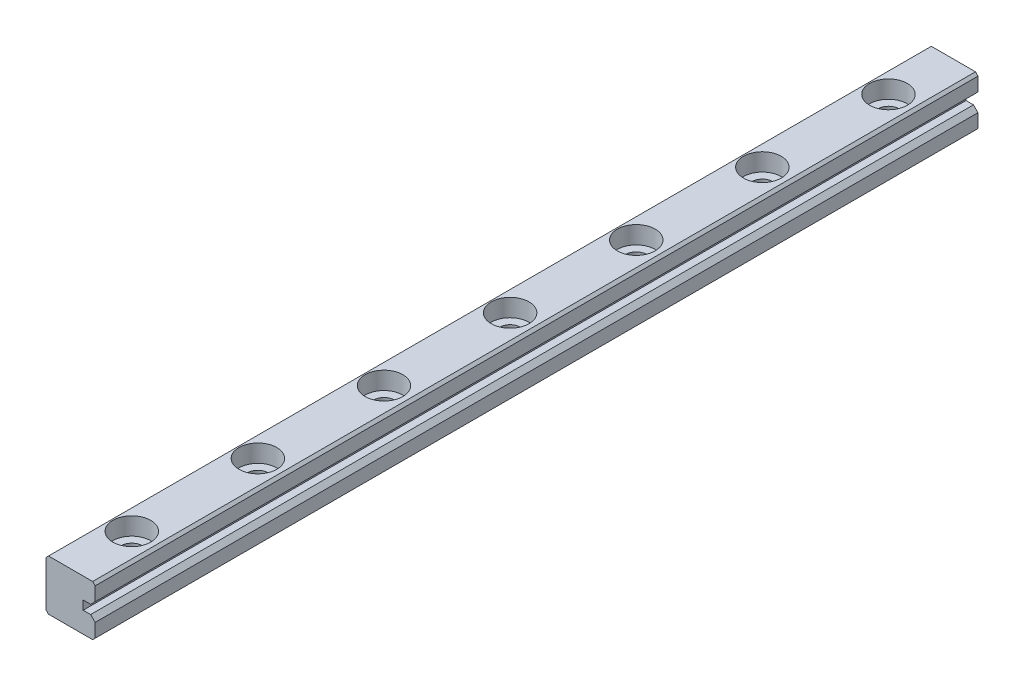
ISO-10303-21;
HEADER;
FILE_DESCRIPTION(('STEP AP214'),'2;1');
FILE_NAME('part.step','',(''),(''),'','','');
FILE_SCHEMA(('AUTOMOTIVE_DESIGN { 1 0 10303 214 1 1 1 1 }'));
ENDSEC;
DATA;
#1=APPLICATION_CONTEXT('core data for automotive mechanical design processes');
#2=APPLICATION_PROTOCOL_DEFINITION('international standard','automotive_design',2000,#1);
#3=PRODUCT_CONTEXT('',#1,'mechanical');
#4=PRODUCT('Part','Part','',(#3));
#5=PRODUCT_RELATED_PRODUCT_CATEGORY('part','',(#4));
#6=PRODUCT_DEFINITION_FORMATION('','',#4);
#7=PRODUCT_DEFINITION_CONTEXT('part definition',#1,'design');
#8=PRODUCT_DEFINITION('design','',#6,#7);
#9=PRODUCT_DEFINITION_SHAPE('','',#8);
#10=(LENGTH_UNIT() NAMED_UNIT(*) SI_UNIT(.MILLI.,.METRE.));
#11=(NAMED_UNIT(*) PLANE_ANGLE_UNIT() SI_UNIT($,.RADIAN.));
#12=(NAMED_UNIT(*) SI_UNIT($,.STERADIAN.) SOLID_ANGLE_UNIT());
#13=UNCERTAINTY_MEASURE_WITH_UNIT(LENGTH_MEASURE(1.E-05),#10,'distance_accuracy_value','');
#14=(GEOMETRIC_REPRESENTATION_CONTEXT(3) GLOBAL_UNCERTAINTY_ASSIGNED_CONTEXT((#13)) GLOBAL_UNIT_ASSIGNED_CONTEXT((#10,
#11,#12)) REPRESENTATION_CONTEXT('',''));
#15=CARTESIAN_POINT('',(0.,0.,0.));
#16=DIRECTION('',(0.,0.,1.));
#17=DIRECTION('',(1.,0.,0.));
#18=AXIS2_PLACEMENT_3D('',#15,#16,#17);
#19=CARTESIAN_POINT('',(2.95,1.65,-70.));
#20=DIRECTION('',(1.,0.,0.));
#21=DIRECTION('',(0.,0.,-1.));
#22=AXIS2_PLACEMENT_3D('',#19,#20,#21);
#23=PLANE('',#22);
#24=DIRECTION('',(0.,1.,0.));
#25=VECTOR('',#24,1.);
#26=CARTESIAN_POINT('',(2.95,1.65,-70.));
#27=LINE('',#26,#25);
#28=CARTESIAN_POINT('',(2.95,1.65,-70.));
#29=VERTEX_POINT('',#28);
#30=CARTESIAN_POINT('',(2.95,2.35,-70.));
#31=VERTEX_POINT('',#30);
#32=EDGE_CURVE('E114',#29,#31,#27,.T.);
#33=ORIENTED_EDGE('',*,*,#32,.T.);
#34=DIRECTION('',(0.,0.,-1.));
#35=VECTOR('',#34,1.);
#36=CARTESIAN_POINT('',(2.95,2.35,-70.));
#37=LINE('',#36,#35);
#38=CARTESIAN_POINT('',(2.95,2.35,0.));
#39=VERTEX_POINT('',#38);
#40=EDGE_CURVE('E136',#39,#31,#37,.T.);
#41=ORIENTED_EDGE('',*,*,#40,.F.);
#42=DIRECTION('',(0.,1.,0.));
#43=VECTOR('',#42,1.);
#44=CARTESIAN_POINT('',(2.95,1.65,0.));
#45=LINE('',#44,#43);
#46=CARTESIAN_POINT('',(2.95,1.65,0.));
#47=VERTEX_POINT('',#46);
#48=EDGE_CURVE('E122',#39,#47,#45,.F.);
#49=ORIENTED_EDGE('',*,*,#48,.T.);
#50=DIRECTION('',(0.,0.,1.));
#51=VECTOR('',#50,1.);
#52=CARTESIAN_POINT('',(2.95,1.65,-70.));
#53=LINE('',#52,#51);
#54=EDGE_CURVE('E133',#29,#47,#53,.T.);
#55=ORIENTED_EDGE('',*,*,#54,.F.);
#56=EDGE_LOOP('',(#33,#41,#49,#55));
#57=FACE_BOUND('',#56,.T.);
#58=ADVANCED_FACE('F16',(#57),#23,.T.);
#59=CARTESIAN_POINT('',(3.54,1.65,-70.));
#60=DIRECTION('',(0.,1.,0.));
#61=DIRECTION('',(-1.,0.,0.));
#62=AXIS2_PLACEMENT_3D('',#59,#60,#61);
#63=PLANE('',#62);
#64=DIRECTION('',(-1.,0.,0.));
#65=VECTOR('',#64,1.);
#66=CARTESIAN_POINT('',(3.54,1.65,-70.));
#67=LINE('',#66,#65);
#68=CARTESIAN_POINT('',(3.54,1.65,-70.));
#69=VERTEX_POINT('',#68);
#70=EDGE_CURVE('E130',#69,#29,#67,.T.);
#71=ORIENTED_EDGE('',*,*,#70,.T.);
#72=ORIENTED_EDGE('',*,*,#54,.T.);
#73=DIRECTION('',(-1.,0.,0.));
#74=VECTOR('',#73,1.);
#75=CARTESIAN_POINT('',(3.54,1.65,0.));
#76=LINE('',#75,#74);
#77=CARTESIAN_POINT('',(3.54,1.65,0.));
#78=VERTEX_POINT('',#77);
#79=EDGE_CURVE('E118',#47,#78,#76,.F.);
#80=ORIENTED_EDGE('',*,*,#79,.T.);
#81=DIRECTION('',(0.,0.,1.));
#82=VECTOR('',#81,1.);
#83=CARTESIAN_POINT('',(3.54,1.65,-70.));
#84=LINE('',#83,#82);
#85=EDGE_CURVE('E268',#69,#78,#84,.T.);
#86=ORIENTED_EDGE('',*,*,#85,.F.);
#87=EDGE_LOOP('',(#71,#72,#80,#86));
#88=FACE_BOUND('',#87,.T.);
#89=ADVANCED_FACE('F139',(#88),#63,.T.);
#90=CARTESIAN_POINT('',(2.95,2.35,-70.));
#91=DIRECTION('',(0.,-1.,0.));
#92=DIRECTION('',(0.,0.,-1.));
#93=AXIS2_PLACEMENT_3D('',#90,#91,#92);
#94=PLANE('',#93);
#95=DIRECTION('',(1.,0.,0.));
#96=VECTOR('',#95,1.);
#97=CARTESIAN_POINT('',(2.95,2.35,-70.));
#98=LINE('',#97,#96);
#99=CARTESIAN_POINT('',(3.54,2.35,-70.));
#100=VERTEX_POINT('',#99);
#101=EDGE_CURVE('E274',#31,#100,#98,.T.);
#102=ORIENTED_EDGE('',*,*,#101,.T.);
#103=DIRECTION('',(0.,0.,1.));
#104=VECTOR('',#103,1.);
#105=CARTESIAN_POINT('',(3.54,2.35,-70.));
#106=LINE('',#105,#104);
#107=CARTESIAN_POINT('',(3.54,2.35,0.));
#108=VERTEX_POINT('',#107);
#109=EDGE_CURVE('E262',#108,#100,#106,.F.);
#110=ORIENTED_EDGE('',*,*,#109,.F.);
#111=DIRECTION('',(1.,0.,0.));
#112=VECTOR('',#111,1.);
#113=CARTESIAN_POINT('',(2.95,2.35,0.));
#114=LINE('',#113,#112);
#115=EDGE_CURVE('E140',#108,#39,#114,.F.);
#116=ORIENTED_EDGE('',*,*,#115,.T.);
#117=ORIENTED_EDGE('',*,*,#40,.T.);
#118=EDGE_LOOP('',(#102,#110,#116,#117));
#119=FACE_BOUND('',#118,.T.);
#120=ADVANCED_FACE('F276',(#119),#94,.T.);
#121=CARTESIAN_POINT('',(3.9,1.29,-70.));
#122=DIRECTION('',(0.707106781186551,0.707106781186544,0.));
#123=DIRECTION('',(-0.707106781186544,0.707106781186551,0.));
#124=AXIS2_PLACEMENT_3D('',#121,#122,#123);
#125=PLANE('',#124);
#126=DIRECTION('',(-0.707106781186544,0.707106781186551,0.));
#127=VECTOR('',#126,1.);
#128=CARTESIAN_POINT('',(3.9,1.29,-70.));
#129=LINE('',#128,#127);
#130=CARTESIAN_POINT('',(3.9,1.29,-70.));
#131=VERTEX_POINT('',#130);
#132=EDGE_CURVE('E270',#131,#69,#129,.T.);
#133=ORIENTED_EDGE('',*,*,#132,.T.);
#134=ORIENTED_EDGE('',*,*,#85,.T.);
#135=DIRECTION('',(-0.707106781186544,0.707106781186551,0.));
#136=VECTOR('',#135,1.);
#137=CARTESIAN_POINT('',(3.9,1.29,0.));
#138=LINE('',#137,#136);
#139=CARTESIAN_POINT('',(3.9,1.29,0.));
#140=VERTEX_POINT('',#139);
#141=EDGE_CURVE('E125',#78,#140,#138,.F.);
#142=ORIENTED_EDGE('',*,*,#141,.T.);
#143=DIRECTION('',(0.,0.,-1.));
#144=VECTOR('',#143,1.);
#145=CARTESIAN_POINT('',(3.9,1.29,-70.));
#146=LINE('',#145,#144);
#147=EDGE_CURVE('E250',#131,#140,#146,.F.);
#148=ORIENTED_EDGE('',*,*,#147,.F.);
#149=EDGE_LOOP('',(#133,#134,#142,#148));
#150=FACE_BOUND('',#149,.T.);
#151=ADVANCED_FACE('F316',(#150),#125,.T.);
#152=CARTESIAN_POINT('',(3.9,2.71,-70.));
#153=DIRECTION('',(0.707106781186546,-0.707106781186549,0.));
#154=DIRECTION('',(0.707106781186549,0.707106781186546,0.));
#155=AXIS2_PLACEMENT_3D('',#152,#153,#154);
#156=PLANE('',#155);
#157=DIRECTION('',(0.707106781186549,0.707106781186546,0.));
#158=VECTOR('',#157,1.);
#159=CARTESIAN_POINT('',(3.9,2.71,-70.));
#160=LINE('',#159,#158);
#161=CARTESIAN_POINT('',(3.9,2.71,-70.));
#162=VERTEX_POINT('',#161);
#163=EDGE_CURVE('E259',#100,#162,#160,.T.);
#164=ORIENTED_EDGE('',*,*,#163,.T.);
#165=DIRECTION('',(0.,0.,-1.));
#166=VECTOR('',#165,1.);
#167=CARTESIAN_POINT('',(3.9,2.71,-70.));
#168=LINE('',#167,#166);
#169=CARTESIAN_POINT('',(3.9,2.71,0.));
#170=VERTEX_POINT('',#169);
#171=EDGE_CURVE('E235',#170,#162,#168,.T.);
#172=ORIENTED_EDGE('',*,*,#171,.F.);
#173=DIRECTION('',(0.707106781186549,0.707106781186546,0.));
#174=VECTOR('',#173,1.);
#175=CARTESIAN_POINT('',(3.9,2.71,0.));
#176=LINE('',#175,#174);
#177=EDGE_CURVE('E265',#170,#108,#176,.F.);
#178=ORIENTED_EDGE('',*,*,#177,.T.);
#179=ORIENTED_EDGE('',*,*,#109,.T.);
#180=EDGE_LOOP('',(#164,#172,#178,#179));
#181=FACE_BOUND('',#180,.T.);
#182=ADVANCED_FACE('F281',(#181),#156,.T.);
#183=CARTESIAN_POINT('',(3.9,1.29,-70.));
#184=DIRECTION('',(1.,0.,0.));
#185=DIRECTION('',(0.,0.,-1.));
#186=AXIS2_PLACEMENT_3D('',#183,#184,#185);
#187=PLANE('',#186);
#188=DIRECTION('',(0.,1.,0.));
#189=VECTOR('',#188,1.);
#190=CARTESIAN_POINT('',(3.9,1.29,-70.));
#191=LINE('',#190,#189);
#192=CARTESIAN_POINT('',(3.9,0.199999999999999,-70.));
#193=VERTEX_POINT('',#192);
#194=EDGE_CURVE('E253',#193,#131,#191,.T.);
#195=ORIENTED_EDGE('',*,*,#194,.T.);
#196=ORIENTED_EDGE('',*,*,#147,.T.);
#197=DIRECTION('',(0.,1.,0.));
#198=VECTOR('',#197,1.);
#199=CARTESIAN_POINT('',(3.9,1.29,0.));
#200=LINE('',#199,#198);
#201=CARTESIAN_POINT('',(3.9,0.199999999999999,0.));
#202=VERTEX_POINT('',#201);
#203=EDGE_CURVE('E256',#140,#202,#200,.F.);
#204=ORIENTED_EDGE('',*,*,#203,.T.);
#205=DIRECTION('',(0.,0.,1.));
#206=VECTOR('',#205,1.);
#207=CARTESIAN_POINT('',(3.9,0.199999999999998,-70.));
#208=LINE('',#207,#206);
#209=EDGE_CURVE('E297',#202,#193,#208,.F.);
#210=ORIENTED_EDGE('',*,*,#209,.T.);
#211=EDGE_LOOP('',(#195,#196,#204,#210));
#212=FACE_BOUND('',#211,.T.);
#213=ADVANCED_FACE('F307',(#212),#187,.T.);
#214=CARTESIAN_POINT('',(2.62500000000001,2.6,-65.));
#215=DIRECTION('',(0.,-1.,0.));
#216=DIRECTION('',(0.,0.,-1.));
#217=AXIS2_PLACEMENT_3D('',#214,#215,#216);
#218=PLANE('',#217);
#219=CARTESIAN_POINT('',(1.8,2.6,-65.));
#220=DIRECTION('',(0.,1.,0.));
#221=DIRECTION('',(0.,0.,1.));
#222=AXIS2_PLACEMENT_3D('',#219,#220,#221);
#223=CIRCLE('',#222,1.50000000000002);
#224=CARTESIAN_POINT('',(1.8,2.6,-63.5));
#225=VERTEX_POINT('',#224);
#226=EDGE_CURVE('E211',#225,#225,#223,.T.);
#227=ORIENTED_EDGE('',*,*,#226,.T.);
#228=EDGE_LOOP('',(#227));
#229=FACE_BOUND('',#228,.T.);
#230=CARTESIAN_POINT('',(1.8,2.6,-65.));
#231=DIRECTION('',(0.,1.,0.));
#232=DIRECTION('',(0.,0.,1.));
#233=AXIS2_PLACEMENT_3D('',#230,#231,#232);
#234=CIRCLE('',#233,0.825000000000006);
#235=CARTESIAN_POINT('',(1.8,2.6,-64.175));
#236=VERTEX_POINT('',#235);
#237=EDGE_CURVE('E19',#236,#236,#234,.F.);
#238=ORIENTED_EDGE('',*,*,#237,.T.);
#239=EDGE_LOOP('',(#238));
#240=FACE_BOUND('',#239,.T.);
#241=ADVANCED_FACE('F439',(#229,#240),#218,.F.);
#242=CARTESIAN_POINT('',(2.62500000000001,2.6,-55.));
#243=DIRECTION('',(0.,-1.,0.));
#244=DIRECTION('',(0.,0.,-1.));
#245=AXIS2_PLACEMENT_3D('',#242,#243,#244);
#246=PLANE('',#245);
#247=CARTESIAN_POINT('',(1.8,2.6,-55.));
#248=DIRECTION('',(0.,1.,0.));
#249=DIRECTION('',(0.,0.,1.));
#250=AXIS2_PLACEMENT_3D('',#247,#248,#249);
#251=CIRCLE('',#250,1.50000000000002);
#252=CARTESIAN_POINT('',(1.8,2.6,-53.5));
#253=VERTEX_POINT('',#252);
#254=EDGE_CURVE('E208',#253,#253,#251,.T.);
#255=ORIENTED_EDGE('',*,*,#254,.T.);
#256=EDGE_LOOP('',(#255));
#257=FACE_BOUND('',#256,.T.);
#258=CARTESIAN_POINT('',(1.8,2.6,-55.));
#259=DIRECTION('',(0.,1.,0.));
#260=DIRECTION('',(0.,0.,1.));
#261=AXIS2_PLACEMENT_3D('',#258,#259,#260);
#262=CIRCLE('',#261,0.825000000000013);
#263=CARTESIAN_POINT('',(1.8,2.6,-54.175));
#264=VERTEX_POINT('',#263);
#265=EDGE_CURVE('E230',#264,#264,#262,.F.);
#266=ORIENTED_EDGE('',*,*,#265,.T.);
#267=EDGE_LOOP('',(#266));
#268=FACE_BOUND('',#267,.T.);
#269=ADVANCED_FACE('F435',(#257,#268),#246,.F.);
#270=CARTESIAN_POINT('',(2.62500000000001,2.6,-45.));
#271=DIRECTION('',(0.,-1.,0.));
#272=DIRECTION('',(0.,0.,-1.));
#273=AXIS2_PLACEMENT_3D('',#270,#271,#272);
#274=PLANE('',#273);
#275=CARTESIAN_POINT('',(1.8,2.6,-45.));
#276=DIRECTION('',(0.,1.,0.));
#277=DIRECTION('',(0.,0.,1.));
#278=AXIS2_PLACEMENT_3D('',#275,#276,#277);
#279=CIRCLE('',#278,1.50000000000002);
#280=CARTESIAN_POINT('',(1.8,2.6,-43.5));
#281=VERTEX_POINT('',#280);
#282=EDGE_CURVE('E205',#281,#281,#279,.T.);
#283=ORIENTED_EDGE('',*,*,#282,.T.);
#284=EDGE_LOOP('',(#283));
#285=FACE_BOUND('',#284,.T.);
#286=CARTESIAN_POINT('',(1.8,2.6,-45.));
#287=DIRECTION('',(0.,1.,0.));
#288=DIRECTION('',(0.,0.,1.));
#289=AXIS2_PLACEMENT_3D('',#286,#287,#288);
#290=CIRCLE('',#289,0.825000000000013);
#291=CARTESIAN_POINT('',(1.8,2.6,-44.175));
#292=VERTEX_POINT('',#291);
#293=EDGE_CURVE('E228',#292,#292,#290,.F.);
#294=ORIENTED_EDGE('',*,*,#293,.T.);
#295=EDGE_LOOP('',(#294));
#296=FACE_BOUND('',#295,.T.);
#297=ADVANCED_FACE('F431',(#285,#296),#274,.F.);
#298=CARTESIAN_POINT('',(2.62500000000001,2.6,-35.));
#299=DIRECTION('',(0.,-1.,0.));
#300=DIRECTION('',(0.,0.,-1.));
#301=AXIS2_PLACEMENT_3D('',#298,#299,#300);
#302=PLANE('',#301);
#303=CARTESIAN_POINT('',(1.8,2.6,-35.));
#304=DIRECTION('',(0.,1.,0.));
#305=DIRECTION('',(0.,0.,1.));
#306=AXIS2_PLACEMENT_3D('',#303,#304,#305);
#307=CIRCLE('',#306,1.50000000000002);
#308=CARTESIAN_POINT('',(1.8,2.6,-33.5));
#309=VERTEX_POINT('',#308);
#310=EDGE_CURVE('E202',#309,#309,#307,.T.);
#311=ORIENTED_EDGE('',*,*,#310,.T.);
#312=EDGE_LOOP('',(#311));
#313=FACE_BOUND('',#312,.T.);
#314=CARTESIAN_POINT('',(1.8,2.6,-35.));
#315=DIRECTION('',(0.,1.,0.));
#316=DIRECTION('',(0.,0.,1.));
#317=AXIS2_PLACEMENT_3D('',#314,#315,#316);
#318=CIRCLE('',#317,0.825000000000013);
#319=CARTESIAN_POINT('',(1.8,2.6,-34.175));
#320=VERTEX_POINT('',#319);
#321=EDGE_CURVE('E225',#320,#320,#318,.F.);
#322=ORIENTED_EDGE('',*,*,#321,.T.);
#323=EDGE_LOOP('',(#322));
#324=FACE_BOUND('',#323,.T.);
#325=ADVANCED_FACE('F427',(#313,#324),#302,.F.);
#326=CARTESIAN_POINT('',(2.62500000000001,2.6,-25.));
#327=DIRECTION('',(0.,-1.,0.));
#328=DIRECTION('',(0.,0.,-1.));
#329=AXIS2_PLACEMENT_3D('',#326,#327,#328);
#330=PLANE('',#329);
#331=CARTESIAN_POINT('',(1.8,2.6,-25.));
#332=DIRECTION('',(0.,1.,0.));
#333=DIRECTION('',(0.,0.,1.));
#334=AXIS2_PLACEMENT_3D('',#331,#332,#333);
#335=CIRCLE('',#334,1.50000000000002);
#336=CARTESIAN_POINT('',(1.8,2.6,-23.5));
#337=VERTEX_POINT('',#336);
#338=EDGE_CURVE('E199',#337,#337,#335,.T.);
#339=ORIENTED_EDGE('',*,*,#338,.T.);
#340=EDGE_LOOP('',(#339));
#341=FACE_BOUND('',#340,.T.);
#342=CARTESIAN_POINT('',(1.8,2.6,-25.));
#343=DIRECTION('',(0.,1.,0.));
#344=DIRECTION('',(0.,0.,1.));
#345=AXIS2_PLACEMENT_3D('',#342,#343,#344);
#346=CIRCLE('',#345,0.825000000000013);
#347=CARTESIAN_POINT('',(1.8,2.6,-24.175));
#348=VERTEX_POINT('',#347);
#349=EDGE_CURVE('E222',#348,#348,#346,.F.);
#350=ORIENTED_EDGE('',*,*,#349,.T.);
#351=EDGE_LOOP('',(#350));
#352=FACE_BOUND('',#351,.T.);
#353=ADVANCED_FACE('F423',(#341,#352),#330,.F.);
#354=CARTESIAN_POINT('',(2.62500000000001,2.6,-15.));
#355=DIRECTION('',(0.,-1.,0.));
#356=DIRECTION('',(0.,0.,-1.));
#357=AXIS2_PLACEMENT_3D('',#354,#355,#356);
#358=PLANE('',#357);
#359=CARTESIAN_POINT('',(1.8,2.6,-15.));
#360=DIRECTION('',(0.,1.,0.));
#361=DIRECTION('',(0.,0.,1.));
#362=AXIS2_PLACEMENT_3D('',#359,#360,#361);
#363=CIRCLE('',#362,1.50000000000001);
#364=CARTESIAN_POINT('',(1.8,2.6,-13.5));
#365=VERTEX_POINT('',#364);
#366=EDGE_CURVE('E196',#365,#365,#363,.T.);
#367=ORIENTED_EDGE('',*,*,#366,.T.);
#368=EDGE_LOOP('',(#367));
#369=FACE_BOUND('',#368,.T.);
#370=CARTESIAN_POINT('',(1.8,2.6,-15.));
#371=DIRECTION('',(0.,1.,0.));
#372=DIRECTION('',(0.,0.,1.));
#373=AXIS2_PLACEMENT_3D('',#370,#371,#372);
#374=CIRCLE('',#373,0.825000000000013);
#375=CARTESIAN_POINT('',(1.8,2.6,-14.175));
#376=VERTEX_POINT('',#375);
#377=EDGE_CURVE('E219',#376,#376,#374,.F.);
#378=ORIENTED_EDGE('',*,*,#377,.T.);
#379=EDGE_LOOP('',(#378));
#380=FACE_BOUND('',#379,.T.);
#381=ADVANCED_FACE('F419',(#369,#380),#358,.F.);
#382=CARTESIAN_POINT('',(2.62500000000001,2.6,-5.));
#383=DIRECTION('',(0.,-1.,0.));
#384=DIRECTION('',(0.,0.,-1.));
#385=AXIS2_PLACEMENT_3D('',#382,#383,#384);
#386=PLANE('',#385);
#387=CARTESIAN_POINT('',(1.8,2.6,-5.));
#388=DIRECTION('',(0.,1.,0.));
#389=DIRECTION('',(0.,0.,1.));
#390=AXIS2_PLACEMENT_3D('',#387,#388,#389);
#391=CIRCLE('',#390,1.50000000000001);
#392=CARTESIAN_POINT('',(1.8,2.6,-3.49999999999999));
#393=VERTEX_POINT('',#392);
#394=EDGE_CURVE('E192',#393,#393,#391,.T.);
#395=ORIENTED_EDGE('',*,*,#394,.T.);
#396=EDGE_LOOP('',(#395));
#397=FACE_BOUND('',#396,.T.);
#398=CARTESIAN_POINT('',(1.8,2.6,-5.));
#399=DIRECTION('',(0.,1.,0.));
#400=DIRECTION('',(0.,0.,1.));
#401=AXIS2_PLACEMENT_3D('',#398,#399,#400);
#402=CIRCLE('',#401,0.825000000000013);
#403=CARTESIAN_POINT('',(1.8,2.6,-4.17499999999999));
#404=VERTEX_POINT('',#403);
#405=EDGE_CURVE('E215',#404,#404,#402,.F.);
#406=ORIENTED_EDGE('',*,*,#405,.T.);
#407=EDGE_LOOP('',(#406));
#408=FACE_BOUND('',#407,.T.);
#409=ADVANCED_FACE('F416',(#397,#408),#386,.F.);
#410=CARTESIAN_POINT('',(3.9,4.,-70.));
#411=DIRECTION('',(1.,0.,0.));
#412=DIRECTION('',(0.,0.,-1.));
#413=AXIS2_PLACEMENT_3D('',#410,#411,#412);
#414=PLANE('',#413);
#415=DIRECTION('',(0.,1.,0.));
#416=VECTOR('',#415,1.);
#417=CARTESIAN_POINT('',(3.9,4.,0.));
#418=LINE('',#417,#416);
#419=CARTESIAN_POINT('',(3.9,3.80000000000001,0.));
#420=VERTEX_POINT('',#419);
#421=EDGE_CURVE('E239',#420,#170,#418,.F.);
#422=ORIENTED_EDGE('',*,*,#421,.T.);
#423=ORIENTED_EDGE('',*,*,#171,.T.);
#424=DIRECTION('',(0.,1.,0.));
#425=VECTOR('',#424,1.);
#426=CARTESIAN_POINT('',(3.9,4.,-70.));
#427=LINE('',#426,#425);
#428=CARTESIAN_POINT('',(3.9,3.80000000000001,-70.));
#429=VERTEX_POINT('',#428);
#430=EDGE_CURVE('E244',#162,#429,#427,.T.);
#431=ORIENTED_EDGE('',*,*,#430,.T.);
#432=DIRECTION('',(0.,0.,1.));
#433=VECTOR('',#432,1.);
#434=CARTESIAN_POINT('',(3.9,3.80000000000001,-70.));
#435=LINE('',#434,#433);
#436=EDGE_CURVE('E195',#429,#420,#435,.T.);
#437=ORIENTED_EDGE('',*,*,#436,.T.);
#438=EDGE_LOOP('',(#422,#423,#431,#437));
#439=FACE_BOUND('',#438,.T.);
#440=ADVANCED_FACE('F282',(#439),#414,.T.);
#441=CARTESIAN_POINT('',(1.8,4.,-65.));
#442=DIRECTION('',(0.,1.,0.));
#443=DIRECTION('',(0.,0.,1.));
#444=AXIS2_PLACEMENT_3D('',#441,#442,#443);
#445=CYLINDRICAL_SURFACE('',#444,0.825000000000006);
#446=ORIENTED_EDGE('',*,*,#237,.F.);
#447=EDGE_LOOP('',(#446));
#448=FACE_BOUND('',#447,.T.);
#449=CARTESIAN_POINT('',(1.8,0.,-65.));
#450=DIRECTION('',(0.,1.,0.));
#451=DIRECTION('',(0.,0.,1.));
#452=AXIS2_PLACEMENT_3D('',#449,#450,#451);
#453=CIRCLE('',#452,0.825000000000006);
#454=CARTESIAN_POINT('',(1.8,0.,-64.175));
#455=VERTEX_POINT('',#454);
#456=EDGE_CURVE('E188',#455,#455,#453,.T.);
#457=ORIENTED_EDGE('',*,*,#456,.F.);
#458=EDGE_LOOP('',(#457));
#459=FACE_BOUND('',#458,.T.);
#460=ADVANCED_FACE('F409',(#448,#459),#445,.F.);
#461=CARTESIAN_POINT('',(1.8,4.,-55.));
#462=DIRECTION('',(0.,1.,0.));
#463=DIRECTION('',(0.,0.,1.));
#464=AXIS2_PLACEMENT_3D('',#461,#462,#463);
#465=CYLINDRICAL_SURFACE('',#464,0.825000000000013);
#466=ORIENTED_EDGE('',*,*,#265,.F.);
#467=EDGE_LOOP('',(#466));
#468=FACE_BOUND('',#467,.T.);
#469=CARTESIAN_POINT('',(1.8,0.,-55.));
#470=DIRECTION('',(0.,1.,0.));
#471=DIRECTION('',(0.,0.,1.));
#472=AXIS2_PLACEMENT_3D('',#469,#470,#471);
#473=CIRCLE('',#472,0.825000000000013);
#474=CARTESIAN_POINT('',(1.8,0.,-54.175));
#475=VERTEX_POINT('',#474);
#476=EDGE_CURVE('E185',#475,#475,#473,.T.);
#477=ORIENTED_EDGE('',*,*,#476,.F.);
#478=EDGE_LOOP('',(#477));
#479=FACE_BOUND('',#478,.T.);
#480=ADVANCED_FACE('F405',(#468,#479),#465,.F.);
#481=CARTESIAN_POINT('',(1.8,4.,-45.));
#482=DIRECTION('',(0.,1.,0.));
#483=DIRECTION('',(0.,0.,1.));
#484=AXIS2_PLACEMENT_3D('',#481,#482,#483);
#485=CYLINDRICAL_SURFACE('',#484,0.825000000000013);
#486=ORIENTED_EDGE('',*,*,#293,.F.);
#487=EDGE_LOOP('',(#486));
#488=FACE_BOUND('',#487,.T.);
#489=CARTESIAN_POINT('',(1.8,0.,-45.));
#490=DIRECTION('',(0.,1.,0.));
#491=DIRECTION('',(0.,0.,1.));
#492=AXIS2_PLACEMENT_3D('',#489,#490,#491);
#493=CIRCLE('',#492,0.825000000000013);
#494=CARTESIAN_POINT('',(1.8,0.,-44.175));
#495=VERTEX_POINT('',#494);
#496=EDGE_CURVE('E182',#495,#495,#493,.T.);
#497=ORIENTED_EDGE('',*,*,#496,.F.);
#498=EDGE_LOOP('',(#497));
#499=FACE_BOUND('',#498,.T.);
#500=ADVANCED_FACE('F401',(#488,#499),#485,.F.);
#501=CARTESIAN_POINT('',(1.8,4.,-35.));
#502=DIRECTION('',(0.,1.,0.));
#503=DIRECTION('',(0.,0.,1.));
#504=AXIS2_PLACEMENT_3D('',#501,#502,#503);
#505=CYLINDRICAL_SURFACE('',#504,0.825000000000013);
#506=ORIENTED_EDGE('',*,*,#321,.F.);
#507=EDGE_LOOP('',(#506));
#508=FACE_BOUND('',#507,.T.);
#509=CARTESIAN_POINT('',(1.8,0.,-35.));
#510=DIRECTION('',(0.,1.,0.));
#511=DIRECTION('',(0.,0.,1.));
#512=AXIS2_PLACEMENT_3D('',#509,#510,#511);
#513=CIRCLE('',#512,0.825000000000013);
#514=CARTESIAN_POINT('',(1.8,0.,-34.175));
#515=VERTEX_POINT('',#514);
#516=EDGE_CURVE('E179',#515,#515,#513,.T.);
#517=ORIENTED_EDGE('',*,*,#516,.F.);
#518=EDGE_LOOP('',(#517));
#519=FACE_BOUND('',#518,.T.);
#520=ADVANCED_FACE('F397',(#508,#519),#505,.F.);
#521=CARTESIAN_POINT('',(1.8,4.,-25.));
#522=DIRECTION('',(0.,1.,0.));
#523=DIRECTION('',(0.,0.,1.));
#524=AXIS2_PLACEMENT_3D('',#521,#522,#523);
#525=CYLINDRICAL_SURFACE('',#524,0.825000000000013);
#526=ORIENTED_EDGE('',*,*,#349,.F.);
#527=EDGE_LOOP('',(#526));
#528=FACE_BOUND('',#527,.T.);
#529=CARTESIAN_POINT('',(1.8,0.,-25.));
#530=DIRECTION('',(0.,1.,0.));
#531=DIRECTION('',(0.,0.,1.));
#532=AXIS2_PLACEMENT_3D('',#529,#530,#531);
#533=CIRCLE('',#532,0.825000000000013);
#534=CARTESIAN_POINT('',(1.8,0.,-24.175));
#535=VERTEX_POINT('',#534);
#536=EDGE_CURVE('E176',#535,#535,#533,.T.);
#537=ORIENTED_EDGE('',*,*,#536,.F.);
#538=EDGE_LOOP('',(#537));
#539=FACE_BOUND('',#538,.T.);
#540=ADVANCED_FACE('F393',(#528,#539),#525,.F.);
#541=CARTESIAN_POINT('',(1.8,4.,-15.));
#542=DIRECTION('',(0.,1.,0.));
#543=DIRECTION('',(0.,0.,1.));
#544=AXIS2_PLACEMENT_3D('',#541,#542,#543);
#545=CYLINDRICAL_SURFACE('',#544,0.825000000000013);
#546=ORIENTED_EDGE('',*,*,#377,.F.);
#547=EDGE_LOOP('',(#546));
#548=FACE_BOUND('',#547,.T.);
#549=CARTESIAN_POINT('',(1.8,0.,-15.));
#550=DIRECTION('',(0.,1.,0.));
#551=DIRECTION('',(0.,0.,1.));
#552=AXIS2_PLACEMENT_3D('',#549,#550,#551);
#553=CIRCLE('',#552,0.825000000000013);
#554=CARTESIAN_POINT('',(1.8,0.,-14.175));
#555=VERTEX_POINT('',#554);
#556=EDGE_CURVE('E173',#555,#555,#553,.T.);
#557=ORIENTED_EDGE('',*,*,#556,.F.);
#558=EDGE_LOOP('',(#557));
#559=FACE_BOUND('',#558,.T.);
#560=ADVANCED_FACE('F389',(#548,#559),#545,.F.);
#561=CARTESIAN_POINT('',(1.8,4.,-5.));
#562=DIRECTION('',(0.,1.,0.));
#563=DIRECTION('',(0.,0.,1.));
#564=AXIS2_PLACEMENT_3D('',#561,#562,#563);
#565=CYLINDRICAL_SURFACE('',#564,0.825000000000013);
#566=ORIENTED_EDGE('',*,*,#405,.F.);
#567=EDGE_LOOP('',(#566));
#568=FACE_BOUND('',#567,.T.);
#569=CARTESIAN_POINT('',(1.8,0.,-5.));
#570=DIRECTION('',(0.,1.,0.));
#571=DIRECTION('',(0.,0.,1.));
#572=AXIS2_PLACEMENT_3D('',#569,#570,#571);
#573=CIRCLE('',#572,0.825000000000013);
#574=CARTESIAN_POINT('',(1.8,0.,-4.17499999999999));
#575=VERTEX_POINT('',#574);
#576=EDGE_CURVE('E170',#575,#575,#573,.T.);
#577=ORIENTED_EDGE('',*,*,#576,.F.);
#578=EDGE_LOOP('',(#577));
#579=FACE_BOUND('',#578,.T.);
#580=ADVANCED_FACE('F386',(#568,#579),#565,.F.);
#581=CARTESIAN_POINT('',(3.70000000000001,0.,-70.));
#582=DIRECTION('',(-0.70710678118656,0.707106781186535,0.));
#583=DIRECTION('',(-0.707106781186535,-0.70710678118656,0.));
#584=AXIS2_PLACEMENT_3D('',#581,#582,#583);
#585=PLANE('',#584);
#586=ORIENTED_EDGE('',*,*,#209,.F.);
#587=DIRECTION('',(-0.707106781186535,-0.70710678118656,0.));
#588=VECTOR('',#587,1.);
#589=CARTESIAN_POINT('',(3.70000000000001,0.,0.));
#590=LINE('',#589,#588);
#591=CARTESIAN_POINT('',(3.70000000000001,0.,0.));
#592=VERTEX_POINT('',#591);
#593=EDGE_CURVE('E218',#592,#202,#590,.F.);
#594=ORIENTED_EDGE('',*,*,#593,.F.);
#595=DIRECTION('',(0.,0.,1.));
#596=VECTOR('',#595,1.);
#597=CARTESIAN_POINT('',(3.70000000000001,0.,-70.));
#598=LINE('',#597,#596);
#599=CARTESIAN_POINT('',(3.70000000000001,0.,-70.));
#600=VERTEX_POINT('',#599);
#601=EDGE_CURVE('E169',#600,#592,#598,.T.);
#602=ORIENTED_EDGE('',*,*,#601,.F.);
#603=DIRECTION('',(-0.707106781186535,-0.70710678118656,0.));
#604=VECTOR('',#603,1.);
#605=CARTESIAN_POINT('',(3.70000000000001,0.,-70.));
#606=LINE('',#605,#604);
#607=EDGE_CURVE('E214',#193,#600,#606,.T.);
#608=ORIENTED_EDGE('',*,*,#607,.F.);
#609=EDGE_LOOP('',(#586,#594,#602,#608));
#610=FACE_BOUND('',#609,.T.);
#611=ADVANCED_FACE('F309',(#610),#585,.F.);
#612=CARTESIAN_POINT('',(1.8,4.,-65.));
#613=DIRECTION('',(0.,1.,0.));
#614=DIRECTION('',(0.,0.,1.));
#615=AXIS2_PLACEMENT_3D('',#612,#613,#614);
#616=CYLINDRICAL_SURFACE('',#615,1.50000000000002);
#617=CARTESIAN_POINT('',(1.8,4.,-65.));
#618=DIRECTION('',(0.,1.,0.));
#619=DIRECTION('',(0.,0.,1.));
#620=AXIS2_PLACEMENT_3D('',#617,#618,#619);
#621=CIRCLE('',#620,1.50000000000002);
#622=CARTESIAN_POINT('',(1.8,4.,-63.5));
#623=VERTEX_POINT('',#622);
#624=EDGE_CURVE('E166',#623,#623,#621,.F.);
#625=ORIENTED_EDGE('',*,*,#624,.F.);
#626=EDGE_LOOP('',(#625));
#627=FACE_BOUND('',#626,.T.);
#628=ORIENTED_EDGE('',*,*,#226,.F.);
#629=EDGE_LOOP('',(#628));
#630=FACE_BOUND('',#629,.T.);
#631=ADVANCED_FACE('F379',(#627,#630),#616,.F.);
#632=CARTESIAN_POINT('',(1.8,4.,-55.));
#633=DIRECTION('',(0.,1.,0.));
#634=DIRECTION('',(0.,0.,1.));
#635=AXIS2_PLACEMENT_3D('',#632,#633,#634);
#636=CYLINDRICAL_SURFACE('',#635,1.50000000000002);
#637=CARTESIAN_POINT('',(1.8,4.,-55.));
#638=DIRECTION('',(0.,1.,0.));
#639=DIRECTION('',(0.,0.,1.));
#640=AXIS2_PLACEMENT_3D('',#637,#638,#639);
#641=CIRCLE('',#640,1.50000000000002);
#642=CARTESIAN_POINT('',(1.8,4.,-53.5));
#643=VERTEX_POINT('',#642);
#644=EDGE_CURVE('E163',#643,#643,#641,.F.);
#645=ORIENTED_EDGE('',*,*,#644,.F.);
#646=EDGE_LOOP('',(#645));
#647=FACE_BOUND('',#646,.T.);
#648=ORIENTED_EDGE('',*,*,#254,.F.);
#649=EDGE_LOOP('',(#648));
#650=FACE_BOUND('',#649,.T.);
#651=ADVANCED_FACE('F375',(#647,#650),#636,.F.);
#652=CARTESIAN_POINT('',(1.8,4.,-45.));
#653=DIRECTION('',(0.,1.,0.));
#654=DIRECTION('',(0.,0.,1.));
#655=AXIS2_PLACEMENT_3D('',#652,#653,#654);
#656=CYLINDRICAL_SURFACE('',#655,1.50000000000002);
#657=CARTESIAN_POINT('',(1.8,4.,-45.));
#658=DIRECTION('',(0.,1.,0.));
#659=DIRECTION('',(0.,0.,1.));
#660=AXIS2_PLACEMENT_3D('',#657,#658,#659);
#661=CIRCLE('',#660,1.50000000000002);
#662=CARTESIAN_POINT('',(1.8,4.,-43.5));
#663=VERTEX_POINT('',#662);
#664=EDGE_CURVE('E160',#663,#663,#661,.F.);
#665=ORIENTED_EDGE('',*,*,#664,.F.);
#666=EDGE_LOOP('',(#665));
#667=FACE_BOUND('',#666,.T.);
#668=ORIENTED_EDGE('',*,*,#282,.F.);
#669=EDGE_LOOP('',(#668));
#670=FACE_BOUND('',#669,.T.);
#671=ADVANCED_FACE('F371',(#667,#670),#656,.F.);
#672=CARTESIAN_POINT('',(1.8,4.,-35.));
#673=DIRECTION('',(0.,1.,0.));
#674=DIRECTION('',(0.,0.,1.));
#675=AXIS2_PLACEMENT_3D('',#672,#673,#674);
#676=CYLINDRICAL_SURFACE('',#675,1.50000000000002);
#677=CARTESIAN_POINT('',(1.8,4.,-35.));
#678=DIRECTION('',(0.,1.,0.));
#679=DIRECTION('',(0.,0.,1.));
#680=AXIS2_PLACEMENT_3D('',#677,#678,#679);
#681=CIRCLE('',#680,1.50000000000002);
#682=CARTESIAN_POINT('',(1.8,4.,-33.5));
#683=VERTEX_POINT('',#682);
#684=EDGE_CURVE('E157',#683,#683,#681,.F.);
#685=ORIENTED_EDGE('',*,*,#684,.F.);
#686=EDGE_LOOP('',(#685));
#687=FACE_BOUND('',#686,.T.);
#688=ORIENTED_EDGE('',*,*,#310,.F.);
#689=EDGE_LOOP('',(#688));
#690=FACE_BOUND('',#689,.T.);
#691=ADVANCED_FACE('F367',(#687,#690),#676,.F.);
#692=CARTESIAN_POINT('',(1.8,4.,-25.));
#693=DIRECTION('',(0.,1.,0.));
#694=DIRECTION('',(0.,0.,1.));
#695=AXIS2_PLACEMENT_3D('',#692,#693,#694);
#696=CYLINDRICAL_SURFACE('',#695,1.50000000000002);
#697=CARTESIAN_POINT('',(1.8,4.,-25.));
#698=DIRECTION('',(0.,1.,0.));
#699=DIRECTION('',(0.,0.,1.));
#700=AXIS2_PLACEMENT_3D('',#697,#698,#699);
#701=CIRCLE('',#700,1.50000000000002);
#702=CARTESIAN_POINT('',(1.8,4.,-23.5));
#703=VERTEX_POINT('',#702);
#704=EDGE_CURVE('E154',#703,#703,#701,.F.);
#705=ORIENTED_EDGE('',*,*,#704,.F.);
#706=EDGE_LOOP('',(#705));
#707=FACE_BOUND('',#706,.T.);
#708=ORIENTED_EDGE('',*,*,#338,.F.);
#709=EDGE_LOOP('',(#708));
#710=FACE_BOUND('',#709,.T.);
#711=ADVANCED_FACE('F363',(#707,#710),#696,.F.);
#712=CARTESIAN_POINT('',(1.8,4.,-15.));
#713=DIRECTION('',(0.,1.,0.));
#714=DIRECTION('',(0.,0.,1.));
#715=AXIS2_PLACEMENT_3D('',#712,#713,#714);
#716=CYLINDRICAL_SURFACE('',#715,1.50000000000001);
#717=CARTESIAN_POINT('',(1.8,4.,-15.));
#718=DIRECTION('',(0.,1.,0.));
#719=DIRECTION('',(0.,0.,1.));
#720=AXIS2_PLACEMENT_3D('',#717,#718,#719);
#721=CIRCLE('',#720,1.50000000000001);
#722=CARTESIAN_POINT('',(1.8,4.,-13.5));
#723=VERTEX_POINT('',#722);
#724=EDGE_CURVE('E151',#723,#723,#721,.F.);
#725=ORIENTED_EDGE('',*,*,#724,.F.);
#726=EDGE_LOOP('',(#725));
#727=FACE_BOUND('',#726,.T.);
#728=ORIENTED_EDGE('',*,*,#366,.F.);
#729=EDGE_LOOP('',(#728));
#730=FACE_BOUND('',#729,.T.);
#731=ADVANCED_FACE('F359',(#727,#730),#716,.F.);
#732=CARTESIAN_POINT('',(1.8,4.,-5.));
#733=DIRECTION('',(0.,1.,0.));
#734=DIRECTION('',(0.,0.,1.));
#735=AXIS2_PLACEMENT_3D('',#732,#733,#734);
#736=CYLINDRICAL_SURFACE('',#735,1.50000000000001);
#737=CARTESIAN_POINT('',(1.8,4.,-5.));
#738=DIRECTION('',(0.,1.,0.));
#739=DIRECTION('',(0.,0.,1.));
#740=AXIS2_PLACEMENT_3D('',#737,#738,#739);
#741=CIRCLE('',#740,1.50000000000001);
#742=CARTESIAN_POINT('',(1.8,4.,-3.49999999999999));
#743=VERTEX_POINT('',#742);
#744=EDGE_CURVE('E147',#743,#743,#741,.F.);
#745=ORIENTED_EDGE('',*,*,#744,.F.);
#746=EDGE_LOOP('',(#745));
#747=FACE_BOUND('',#746,.T.);
#748=ORIENTED_EDGE('',*,*,#394,.F.);
#749=EDGE_LOOP('',(#748));
#750=FACE_BOUND('',#749,.T.);
#751=ADVANCED_FACE('F356',(#747,#750),#736,.F.);
#752=CARTESIAN_POINT('',(3.9,3.80000000000001,-70.));
#753=DIRECTION('',(-0.707106781186535,-0.70710678118656,0.));
#754=DIRECTION('',(0.70710678118656,-0.707106781186535,0.));
#755=AXIS2_PLACEMENT_3D('',#752,#753,#754);
#756=PLANE('',#755);
#757=DIRECTION('',(0.,0.,1.));
#758=VECTOR('',#757,1.);
#759=CARTESIAN_POINT('',(3.7,4.,-70.));
#760=LINE('',#759,#758);
#761=CARTESIAN_POINT('',(3.7,4.,0.));
#762=VERTEX_POINT('',#761);
#763=CARTESIAN_POINT('',(3.7,4.,-70.));
#764=VERTEX_POINT('',#763);
#765=EDGE_CURVE('E150',#762,#764,#760,.F.);
#766=ORIENTED_EDGE('',*,*,#765,.F.);
#767=DIRECTION('',(0.70710678118656,-0.707106781186535,0.));
#768=VECTOR('',#767,1.);
#769=CARTESIAN_POINT('',(3.9,3.80000000000001,0.));
#770=LINE('',#769,#768);
#771=EDGE_CURVE('E287',#420,#762,#770,.F.);
#772=ORIENTED_EDGE('',*,*,#771,.F.);
#773=ORIENTED_EDGE('',*,*,#436,.F.);
#774=DIRECTION('',(0.70710678118656,-0.707106781186535,0.));
#775=VECTOR('',#774,1.);
#776=CARTESIAN_POINT('',(3.9,3.80000000000001,-70.));
#777=LINE('',#776,#775);
#778=EDGE_CURVE('E191',#764,#429,#777,.T.);
#779=ORIENTED_EDGE('',*,*,#778,.F.);
#780=EDGE_LOOP('',(#766,#772,#773,#779));
#781=FACE_BOUND('',#780,.T.);
#782=ADVANCED_FACE('F290',(#781),#756,.F.);
#783=CARTESIAN_POINT('',(3.9,0.,-70.));
#784=DIRECTION('',(0.,-1.,0.));
#785=DIRECTION('',(1.,0.,0.));
#786=AXIS2_PLACEMENT_3D('',#783,#784,#785);
#787=PLANE('',#786);
#788=DIRECTION('',(-1.,0.,0.));
#789=VECTOR('',#788,1.);
#790=CARTESIAN_POINT('',(0.,0.,-70.));
#791=LINE('',#790,#789);
#792=CARTESIAN_POINT('',(0.199999999999999,0.,-70.));
#793=VERTEX_POINT('',#792);
#794=EDGE_CURVE('E313',#600,#793,#791,.T.);
#795=ORIENTED_EDGE('',*,*,#794,.F.);
#796=ORIENTED_EDGE('',*,*,#601,.T.);
#797=DIRECTION('',(-1.,0.,0.));
#798=VECTOR('',#797,1.);
#799=CARTESIAN_POINT('',(0.,0.,0.));
#800=LINE('',#799,#798);
#801=CARTESIAN_POINT('',(0.199999999999999,0.,0.));
#802=VERTEX_POINT('',#801);
#803=EDGE_CURVE('E303',#592,#802,#800,.T.);
#804=ORIENTED_EDGE('',*,*,#803,.T.);
#805=DIRECTION('',(0.,0.,1.));
#806=VECTOR('',#805,1.);
#807=CARTESIAN_POINT('',(0.199999999999999,0.,-70.));
#808=LINE('',#807,#806);
#809=EDGE_CURVE('E737',#802,#793,#808,.F.);
#810=ORIENTED_EDGE('',*,*,#809,.T.);
#811=EDGE_LOOP('',(#795,#796,#804,#810));
#812=FACE_BOUND('',#811,.T.);
#813=ORIENTED_EDGE('',*,*,#576,.T.);
#814=EDGE_LOOP('',(#813));
#815=FACE_BOUND('',#814,.T.);
#816=ORIENTED_EDGE('',*,*,#556,.T.);
#817=EDGE_LOOP('',(#816));
#818=FACE_BOUND('',#817,.T.);
#819=ORIENTED_EDGE('',*,*,#536,.T.);
#820=EDGE_LOOP('',(#819));
#821=FACE_BOUND('',#820,.T.);
#822=ORIENTED_EDGE('',*,*,#516,.T.);
#823=EDGE_LOOP('',(#822));
#824=FACE_BOUND('',#823,.T.);
#825=ORIENTED_EDGE('',*,*,#496,.T.);
#826=EDGE_LOOP('',(#825));
#827=FACE_BOUND('',#826,.T.);
#828=ORIENTED_EDGE('',*,*,#476,.T.);
#829=EDGE_LOOP('',(#828));
#830=FACE_BOUND('',#829,.T.);
#831=ORIENTED_EDGE('',*,*,#456,.T.);
#832=EDGE_LOOP('',(#831));
#833=FACE_BOUND('',#832,.T.);
#834=ADVANCED_FACE('F349',(#812,#815,#818,#821,#824,#827,#830,#833),#787,.T.);
#835=CARTESIAN_POINT('',(0.,4.,-70.));
#836=DIRECTION('',(0.,1.,0.));
#837=DIRECTION('',(0.,0.,1.));
#838=AXIS2_PLACEMENT_3D('',#835,#836,#837);
#839=PLANE('',#838);
#840=DIRECTION('',(-1.,0.,0.));
#841=VECTOR('',#840,1.);
#842=CARTESIAN_POINT('',(0.,4.,0.));
#843=LINE('',#842,#841);
#844=CARTESIAN_POINT('',(0.199999999999992,4.,0.));
#845=VERTEX_POINT('',#844);
#846=EDGE_CURVE('E747',#845,#762,#843,.F.);
#847=ORIENTED_EDGE('',*,*,#846,.T.);
#848=ORIENTED_EDGE('',*,*,#765,.T.);
#849=DIRECTION('',(-1.,0.,0.));
#850=VECTOR('',#849,1.);
#851=CARTESIAN_POINT('',(0.,4.,-70.));
#852=LINE('',#851,#850);
#853=CARTESIAN_POINT('',(0.199999999999992,4.,-70.));
#854=VERTEX_POINT('',#853);
#855=EDGE_CURVE('E738',#854,#764,#852,.F.);
#856=ORIENTED_EDGE('',*,*,#855,.F.);
#857=DIRECTION('',(0.,0.,1.));
#858=VECTOR('',#857,1.);
#859=CARTESIAN_POINT('',(0.199999999999992,4.,-70.));
#860=LINE('',#859,#858);
#861=EDGE_CURVE('E752',#854,#845,#860,.T.);
#862=ORIENTED_EDGE('',*,*,#861,.T.);
#863=EDGE_LOOP('',(#847,#848,#856,#862));
#864=FACE_BOUND('',#863,.T.);
#865=ORIENTED_EDGE('',*,*,#744,.T.);
#866=EDGE_LOOP('',(#865));
#867=FACE_BOUND('',#866,.T.);
#868=ORIENTED_EDGE('',*,*,#724,.T.);
#869=EDGE_LOOP('',(#868));
#870=FACE_BOUND('',#869,.T.);
#871=ORIENTED_EDGE('',*,*,#704,.T.);
#872=EDGE_LOOP('',(#871));
#873=FACE_BOUND('',#872,.T.);
#874=ORIENTED_EDGE('',*,*,#684,.T.);
#875=EDGE_LOOP('',(#874));
#876=FACE_BOUND('',#875,.T.);
#877=ORIENTED_EDGE('',*,*,#664,.T.);
#878=EDGE_LOOP('',(#877));
#879=FACE_BOUND('',#878,.T.);
#880=ORIENTED_EDGE('',*,*,#644,.T.);
#881=EDGE_LOOP('',(#880));
#882=FACE_BOUND('',#881,.T.);
#883=ORIENTED_EDGE('',*,*,#624,.T.);
#884=EDGE_LOOP('',(#883));
#885=FACE_BOUND('',#884,.T.);
#886=ADVANCED_FACE('F346',(#864,#867,#870,#873,#876,#879,#882,#885),#839,.T.);
#887=CARTESIAN_POINT('',(0.,0.,-70.));
#888=DIRECTION('',(0.,0.,-1.));
#889=DIRECTION('',(-1.,0.,0.));
#890=AXIS2_PLACEMENT_3D('',#887,#888,#889);
#891=PLANE('',#890);
#892=ORIENTED_EDGE('',*,*,#194,.F.);
#893=ORIENTED_EDGE('',*,*,#607,.T.);
#894=ORIENTED_EDGE('',*,*,#794,.T.);
#895=DIRECTION('',(-0.70710678118656,0.707106781186535,0.));
#896=VECTOR('',#895,1.);
#897=CARTESIAN_POINT('',(0.,0.199999999999992,-70.));
#898=LINE('',#897,#896);
#899=CARTESIAN_POINT('',(0.,0.199999999999992,-70.));
#900=VERTEX_POINT('',#899);
#901=EDGE_CURVE('E745',#793,#900,#898,.T.);
#902=ORIENTED_EDGE('',*,*,#901,.T.);
#903=DIRECTION('',(0.,1.,0.));
#904=VECTOR('',#903,1.);
#905=CARTESIAN_POINT('',(0.,0.,-70.));
#906=LINE('',#905,#904);
#907=CARTESIAN_POINT('',(0.,3.8,-70.));
#908=VERTEX_POINT('',#907);
#909=EDGE_CURVE('E758',#908,#900,#906,.F.);
#910=ORIENTED_EDGE('',*,*,#909,.F.);
#911=DIRECTION('',(0.707106781186535,0.70710678118656,0.));
#912=VECTOR('',#911,1.);
#913=CARTESIAN_POINT('',(0.199999999999992,4.,-70.));
#914=LINE('',#913,#912);
#915=EDGE_CURVE('E755',#908,#854,#914,.T.);
#916=ORIENTED_EDGE('',*,*,#915,.T.);
#917=ORIENTED_EDGE('',*,*,#855,.T.);
#918=ORIENTED_EDGE('',*,*,#778,.T.);
#919=ORIENTED_EDGE('',*,*,#430,.F.);
#920=ORIENTED_EDGE('',*,*,#163,.F.);
#921=ORIENTED_EDGE('',*,*,#101,.F.);
#922=ORIENTED_EDGE('',*,*,#32,.F.);
#923=ORIENTED_EDGE('',*,*,#70,.F.);
#924=ORIENTED_EDGE('',*,*,#132,.F.);
#925=EDGE_LOOP('',(#892,#893,#894,#902,#910,#916,#917,#918,#919,#920,#921,#922,#923,#924));
#926=FACE_BOUND('',#925,.T.);
#927=ADVANCED_FACE('F312',(#926),#891,.T.);
#928=CARTESIAN_POINT('',(0.,0.199999999999992,-70.));
#929=DIRECTION('',(0.707106781186535,0.70710678118656,0.));
#930=DIRECTION('',(-0.70710678118656,0.707106781186535,0.));
#931=AXIS2_PLACEMENT_3D('',#928,#929,#930);
#932=PLANE('',#931);
#933=ORIENTED_EDGE('',*,*,#809,.F.);
#934=DIRECTION('',(-0.70710678118656,0.707106781186535,0.));
#935=VECTOR('',#934,1.);
#936=CARTESIAN_POINT('',(0.199999999999999,0.,0.));
#937=LINE('',#936,#935);
#938=CARTESIAN_POINT('',(0.,0.199999999999992,0.));
#939=VERTEX_POINT('',#938);
#940=EDGE_CURVE('E750',#802,#939,#937,.T.);
#941=ORIENTED_EDGE('',*,*,#940,.T.);
#942=DIRECTION('',(0.,0.,1.));
#943=VECTOR('',#942,1.);
#944=CARTESIAN_POINT('',(0.,0.199999999999992,-70.));
#945=LINE('',#944,#943);
#946=EDGE_CURVE('E761',#900,#939,#945,.T.);
#947=ORIENTED_EDGE('',*,*,#946,.F.);
#948=ORIENTED_EDGE('',*,*,#901,.F.);
#949=EDGE_LOOP('',(#933,#941,#947,#948));
#950=FACE_BOUND('',#949,.T.);
#951=ADVANCED_FACE('F340',(#950),#932,.F.);
#952=CARTESIAN_POINT('',(0.,0.,0.));
#953=DIRECTION('',(0.,0.,-1.));
#954=DIRECTION('',(-1.,0.,0.));
#955=AXIS2_PLACEMENT_3D('',#952,#953,#954);
#956=PLANE('',#955);
#957=ORIENTED_EDGE('',*,*,#940,.F.);
#958=ORIENTED_EDGE('',*,*,#803,.F.);
#959=ORIENTED_EDGE('',*,*,#593,.T.);
#960=ORIENTED_EDGE('',*,*,#203,.F.);
#961=ORIENTED_EDGE('',*,*,#141,.F.);
#962=ORIENTED_EDGE('',*,*,#79,.F.);
#963=ORIENTED_EDGE('',*,*,#48,.F.);
#964=ORIENTED_EDGE('',*,*,#115,.F.);
#965=ORIENTED_EDGE('',*,*,#177,.F.);
#966=ORIENTED_EDGE('',*,*,#421,.F.);
#967=ORIENTED_EDGE('',*,*,#771,.T.);
#968=ORIENTED_EDGE('',*,*,#846,.F.);
#969=DIRECTION('',(0.707106781186535,0.70710678118656,0.));
#970=VECTOR('',#969,1.);
#971=CARTESIAN_POINT('',(0.199999999999992,4.,0.));
#972=LINE('',#971,#970);
#973=CARTESIAN_POINT('',(0.,3.8,0.));
#974=VERTEX_POINT('',#973);
#975=EDGE_CURVE('E34',#845,#974,#972,.F.);
#976=ORIENTED_EDGE('',*,*,#975,.T.);
#977=DIRECTION('',(0.,1.,0.));
#978=VECTOR('',#977,1.);
#979=CARTESIAN_POINT('',(0.,0.,0.));
#980=LINE('',#979,#978);
#981=EDGE_CURVE('E25',#939,#974,#980,.T.);
#982=ORIENTED_EDGE('',*,*,#981,.F.);
#983=EDGE_LOOP('',(#957,#958,#959,#960,#961,#962,#963,#964,#965,#966,#967,#968,#976,#982));
#984=FACE_BOUND('',#983,.T.);
#985=ADVANCED_FACE('F121',(#984),#956,.F.);
#986=CARTESIAN_POINT('',(0.199999999999992,4.,-70.));
#987=DIRECTION('',(0.70710678118656,-0.707106781186535,0.));
#988=DIRECTION('',(0.707106781186535,0.70710678118656,0.));
#989=AXIS2_PLACEMENT_3D('',#986,#987,#988);
#990=PLANE('',#989);
#991=DIRECTION('',(0.,0.,1.));
#992=VECTOR('',#991,1.);
#993=CARTESIAN_POINT('',(0.,3.8,-70.));
#994=LINE('',#993,#992);
#995=EDGE_CURVE('E11',#974,#908,#994,.F.);
#996=ORIENTED_EDGE('',*,*,#995,.F.);
#997=ORIENTED_EDGE('',*,*,#975,.F.);
#998=ORIENTED_EDGE('',*,*,#861,.F.);
#999=ORIENTED_EDGE('',*,*,#915,.F.);
#1000=EDGE_LOOP('',(#996,#997,#998,#999));
#1001=FACE_BOUND('',#1000,.T.);
#1002=ADVANCED_FACE('F328',(#1001),#990,.F.);
#1003=CARTESIAN_POINT('',(0.,0.,-70.));
#1004=DIRECTION('',(-1.,0.,0.));
#1005=DIRECTION('',(0.,0.,1.));
#1006=AXIS2_PLACEMENT_3D('',#1003,#1004,#1005);
#1007=PLANE('',#1006);
#1008=ORIENTED_EDGE('',*,*,#981,.T.);
#1009=ORIENTED_EDGE('',*,*,#995,.T.);
#1010=ORIENTED_EDGE('',*,*,#909,.T.);
#1011=ORIENTED_EDGE('',*,*,#946,.T.);
#1012=EDGE_LOOP('',(#1008,#1009,#1010,#1011));
#1013=FACE_BOUND('',#1012,.T.);
#1014=ADVANCED_FACE('F326',(#1013),#1007,.T.);
#1015=CLOSED_SHELL('',(#58,#89,#120,#151,#182,#213,#241,#269,#297,#325,#353,#381,#409,#440,#460,
#480,#500,#520,#540,#560,#580,#611,#631,#651,#671,#691,#711,#731,#751,#782,#834,#886,#927,#951,
#985,#1002,#1014));
#1016=MANIFOLD_SOLID_BREP('B1',#1015);
#1017=ADVANCED_BREP_SHAPE_REPRESENTATION('',(#18,#1016),#14);
#1018=SHAPE_DEFINITION_REPRESENTATION(#9,#1017);
ENDSEC;
END-ISO-10303-21;
